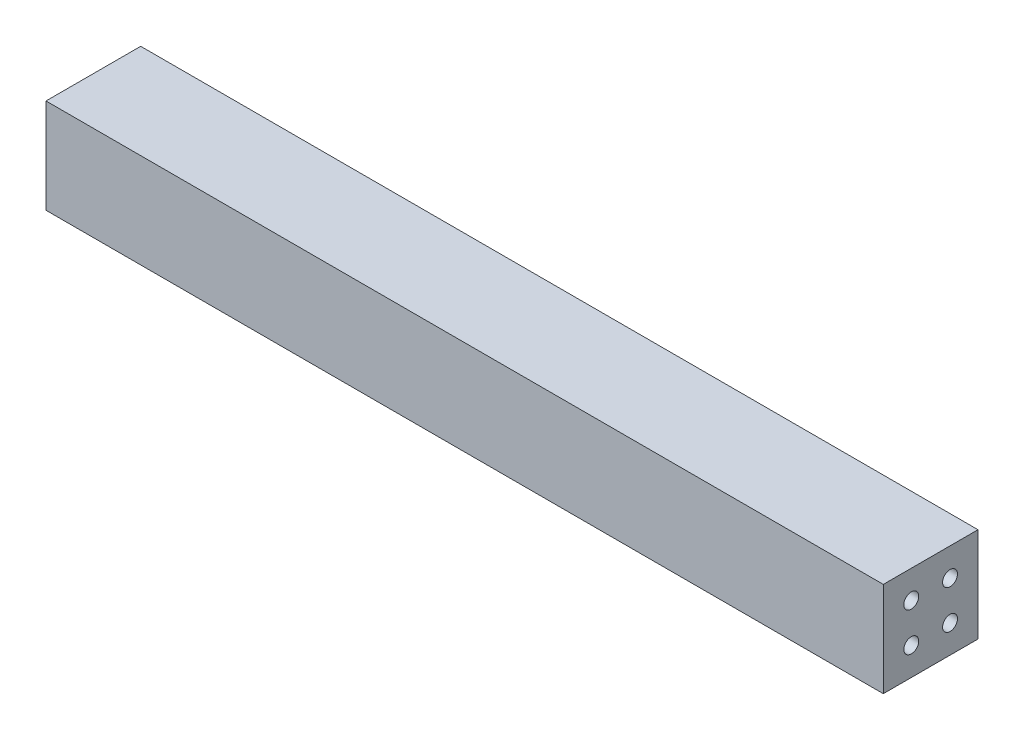
ISO-10303-21;
HEADER;
FILE_DESCRIPTION(('STEP AP214'),'2;1');
FILE_NAME('part.step','',(''),(''),'','','');
FILE_SCHEMA(('AUTOMOTIVE_DESIGN { 1 0 10303 214 1 1 1 1 }'));
ENDSEC;
DATA;
#1=APPLICATION_CONTEXT('core data for automotive mechanical design processes');
#2=APPLICATION_PROTOCOL_DEFINITION('international standard','automotive_design',2000,#1);
#3=PRODUCT_CONTEXT('',#1,'mechanical');
#4=PRODUCT('Part','Part','',(#3));
#5=PRODUCT_RELATED_PRODUCT_CATEGORY('part','',(#4));
#6=PRODUCT_DEFINITION_FORMATION('','',#4);
#7=PRODUCT_DEFINITION_CONTEXT('part definition',#1,'design');
#8=PRODUCT_DEFINITION('design','',#6,#7);
#9=PRODUCT_DEFINITION_SHAPE('','',#8);
#10=(LENGTH_UNIT() NAMED_UNIT(*) SI_UNIT(.MILLI.,.METRE.));
#11=(NAMED_UNIT(*) PLANE_ANGLE_UNIT() SI_UNIT($,.RADIAN.));
#12=(NAMED_UNIT(*) SI_UNIT($,.STERADIAN.) SOLID_ANGLE_UNIT());
#13=UNCERTAINTY_MEASURE_WITH_UNIT(LENGTH_MEASURE(1.E-05),#10,'distance_accuracy_value','');
#14=(GEOMETRIC_REPRESENTATION_CONTEXT(3) GLOBAL_UNCERTAINTY_ASSIGNED_CONTEXT((#13)) GLOBAL_UNIT_ASSIGNED_CONTEXT((#10,
#11,#12)) REPRESENTATION_CONTEXT('',''));
#15=CARTESIAN_POINT('',(0.,0.,0.));
#16=DIRECTION('',(0.,0.,1.));
#17=DIRECTION('',(1.,0.,0.));
#18=AXIS2_PLACEMENT_3D('',#15,#16,#17);
#19=CARTESIAN_POINT('',(224.6,50.8,-25.4));
#20=DIRECTION('',(-1.,0.,0.));
#21=DIRECTION('',(0.,0.,1.));
#22=AXIS2_PLACEMENT_3D('',#19,#20,#21);
#23=PLANE('',#22);
#24=CARTESIAN_POINT('',(224.6,15.0000000000001,10.3999999999998));
#25=DIRECTION('',(1.,0.,0.));
#26=DIRECTION('',(0.,0.,-1.));
#27=AXIS2_PLACEMENT_3D('',#24,#25,#26);
#28=CIRCLE('',#27,4.);
#29=CARTESIAN_POINT('',(224.6,15.0000000000001,6.39999999999981));
#30=VERTEX_POINT('',#29);
#31=EDGE_CURVE('E128',#30,#30,#28,.T.);
#32=ORIENTED_EDGE('',*,*,#31,.F.);
#33=EDGE_LOOP('',(#32));
#34=FACE_BOUND('',#33,.T.);
#35=CARTESIAN_POINT('',(224.6,15.0000000000002,-10.4000000000002));
#36=DIRECTION('',(1.,0.,0.));
#37=DIRECTION('',(0.,0.,-1.));
#38=AXIS2_PLACEMENT_3D('',#35,#36,#37);
#39=CIRCLE('',#38,4.);
#40=CARTESIAN_POINT('',(224.6,15.0000000000002,-14.4000000000002));
#41=VERTEX_POINT('',#40);
#42=EDGE_CURVE('E122',#41,#41,#39,.T.);
#43=ORIENTED_EDGE('',*,*,#42,.F.);
#44=EDGE_LOOP('',(#43));
#45=FACE_BOUND('',#44,.T.);
#46=CARTESIAN_POINT('',(224.6,35.8000000000002,-10.4));
#47=DIRECTION('',(1.,0.,0.));
#48=DIRECTION('',(0.,0.,-1.));
#49=AXIS2_PLACEMENT_3D('',#46,#47,#48);
#50=CIRCLE('',#49,4.);
#51=CARTESIAN_POINT('',(224.6,35.8000000000002,-14.4));
#52=VERTEX_POINT('',#51);
#53=EDGE_CURVE('E116',#52,#52,#50,.T.);
#54=ORIENTED_EDGE('',*,*,#53,.F.);
#55=EDGE_LOOP('',(#54));
#56=FACE_BOUND('',#55,.T.);
#57=CARTESIAN_POINT('',(224.6,35.8,10.4));
#58=DIRECTION('',(1.,0.,0.));
#59=DIRECTION('',(0.,0.,-1.));
#60=AXIS2_PLACEMENT_3D('',#57,#58,#59);
#61=CIRCLE('',#60,4.);
#62=CARTESIAN_POINT('',(224.6,35.8,6.39999999999999));
#63=VERTEX_POINT('',#62);
#64=EDGE_CURVE('E110',#63,#63,#61,.T.);
#65=ORIENTED_EDGE('',*,*,#64,.F.);
#66=EDGE_LOOP('',(#65));
#67=FACE_BOUND('',#66,.T.);
#68=DIRECTION('',(0.,0.,-1.));
#69=VECTOR('',#68,1.);
#70=CARTESIAN_POINT('',(224.6,0.,-25.4));
#71=LINE('',#70,#69);
#72=CARTESIAN_POINT('',(224.6,0.,25.4));
#73=VERTEX_POINT('',#72);
#74=CARTESIAN_POINT('',(224.6,0.,-25.4));
#75=VERTEX_POINT('',#74);
#76=EDGE_CURVE('E96',#73,#75,#71,.T.);
#77=ORIENTED_EDGE('',*,*,#76,.T.);
#78=DIRECTION('',(0.,-1.,0.));
#79=VECTOR('',#78,1.);
#80=CARTESIAN_POINT('',(224.6,50.8,-25.4));
#81=LINE('',#80,#79);
#82=CARTESIAN_POINT('',(224.6,50.8,-25.4));
#83=VERTEX_POINT('',#82);
#84=EDGE_CURVE('E11',#83,#75,#81,.T.);
#85=ORIENTED_EDGE('',*,*,#84,.F.);
#86=DIRECTION('',(0.,0.,-1.));
#87=VECTOR('',#86,1.);
#88=CARTESIAN_POINT('',(224.6,50.8,-25.4));
#89=LINE('',#88,#87);
#90=CARTESIAN_POINT('',(224.6,50.8,25.4));
#91=VERTEX_POINT('',#90);
#92=EDGE_CURVE('E84',#91,#83,#89,.T.);
#93=ORIENTED_EDGE('',*,*,#92,.F.);
#94=DIRECTION('',(0.,-1.,0.));
#95=VECTOR('',#94,1.);
#96=CARTESIAN_POINT('',(224.6,50.8,25.4));
#97=LINE('',#96,#95);
#98=EDGE_CURVE('E92',#91,#73,#97,.T.);
#99=ORIENTED_EDGE('',*,*,#98,.T.);
#100=EDGE_LOOP('',(#77,#85,#93,#99));
#101=FACE_BOUND('',#100,.T.);
#102=ADVANCED_FACE('F33',(#34,#45,#56,#67,#101),#23,.F.);
#103=CARTESIAN_POINT('',(-224.6,50.8,-25.4));
#104=DIRECTION('',(0.,0.,1.));
#105=DIRECTION('',(1.,0.,0.));
#106=AXIS2_PLACEMENT_3D('',#103,#104,#105);
#107=PLANE('',#106);
#108=DIRECTION('',(-1.,0.,0.));
#109=VECTOR('',#108,1.);
#110=CARTESIAN_POINT('',(-224.6,0.,-25.4));
#111=LINE('',#110,#109);
#112=CARTESIAN_POINT('',(-224.6,0.,-25.4));
#113=VERTEX_POINT('',#112);
#114=EDGE_CURVE('E88',#75,#113,#111,.T.);
#115=ORIENTED_EDGE('',*,*,#114,.T.);
#116=DIRECTION('',(0.,-1.,0.));
#117=VECTOR('',#116,1.);
#118=CARTESIAN_POINT('',(-224.6,50.8,-25.4));
#119=LINE('',#118,#117);
#120=CARTESIAN_POINT('',(-224.6,50.8,-25.4));
#121=VERTEX_POINT('',#120);
#122=EDGE_CURVE('E41',#121,#113,#119,.T.);
#123=ORIENTED_EDGE('',*,*,#122,.F.);
#124=DIRECTION('',(-1.,0.,0.));
#125=VECTOR('',#124,1.);
#126=CARTESIAN_POINT('',(-224.6,50.8,-25.4));
#127=LINE('',#126,#125);
#128=EDGE_CURVE('E79',#83,#121,#127,.T.);
#129=ORIENTED_EDGE('',*,*,#128,.F.);
#130=ORIENTED_EDGE('',*,*,#84,.T.);
#131=EDGE_LOOP('',(#115,#123,#129,#130));
#132=FACE_BOUND('',#131,.T.);
#133=ADVANCED_FACE('F87',(#132),#107,.F.);
#134=CARTESIAN_POINT('',(-224.6,50.8,-25.4));
#135=DIRECTION('',(1.,0.,0.));
#136=DIRECTION('',(0.,0.,-1.));
#137=AXIS2_PLACEMENT_3D('',#134,#135,#136);
#138=PLANE('',#137);
#139=CARTESIAN_POINT('',(-224.6,15.0000000000001,10.3999999999998));
#140=DIRECTION('',(-1.,0.,0.));
#141=DIRECTION('',(0.,0.,1.));
#142=AXIS2_PLACEMENT_3D('',#139,#140,#141);
#143=CIRCLE('',#142,4.);
#144=CARTESIAN_POINT('',(-224.6,15.0000000000001,14.3999999999998));
#145=VERTEX_POINT('',#144);
#146=EDGE_CURVE('E152',#145,#145,#143,.T.);
#147=ORIENTED_EDGE('',*,*,#146,.F.);
#148=EDGE_LOOP('',(#147));
#149=FACE_BOUND('',#148,.T.);
#150=CARTESIAN_POINT('',(-224.6,15.0000000000002,-10.4000000000002));
#151=DIRECTION('',(-1.,0.,0.));
#152=DIRECTION('',(0.,0.,1.));
#153=AXIS2_PLACEMENT_3D('',#150,#151,#152);
#154=CIRCLE('',#153,4.);
#155=CARTESIAN_POINT('',(-224.6,15.0000000000002,-6.40000000000021));
#156=VERTEX_POINT('',#155);
#157=EDGE_CURVE('E146',#156,#156,#154,.T.);
#158=ORIENTED_EDGE('',*,*,#157,.F.);
#159=EDGE_LOOP('',(#158));
#160=FACE_BOUND('',#159,.T.);
#161=CARTESIAN_POINT('',(-224.6,35.8000000000002,-10.4));
#162=DIRECTION('',(-1.,0.,0.));
#163=DIRECTION('',(0.,0.,1.));
#164=AXIS2_PLACEMENT_3D('',#161,#162,#163);
#165=CIRCLE('',#164,4.00000000000001);
#166=CARTESIAN_POINT('',(-224.6,35.8000000000002,-6.40000000000002));
#167=VERTEX_POINT('',#166);
#168=EDGE_CURVE('E140',#167,#167,#165,.T.);
#169=ORIENTED_EDGE('',*,*,#168,.F.);
#170=EDGE_LOOP('',(#169));
#171=FACE_BOUND('',#170,.T.);
#172=CARTESIAN_POINT('',(-224.6,35.8,10.4));
#173=DIRECTION('',(-1.,0.,0.));
#174=DIRECTION('',(0.,0.,1.));
#175=AXIS2_PLACEMENT_3D('',#172,#173,#174);
#176=CIRCLE('',#175,4.);
#177=CARTESIAN_POINT('',(-224.6,35.8,14.4));
#178=VERTEX_POINT('',#177);
#179=EDGE_CURVE('E134',#178,#178,#176,.T.);
#180=ORIENTED_EDGE('',*,*,#179,.F.);
#181=EDGE_LOOP('',(#180));
#182=FACE_BOUND('',#181,.T.);
#183=DIRECTION('',(0.,0.,1.));
#184=VECTOR('',#183,1.);
#185=CARTESIAN_POINT('',(-224.6,0.,-25.4));
#186=LINE('',#185,#184);
#187=CARTESIAN_POINT('',(-224.6,0.,25.4));
#188=VERTEX_POINT('',#187);
#189=EDGE_CURVE('E66',#113,#188,#186,.T.);
#190=ORIENTED_EDGE('',*,*,#189,.T.);
#191=DIRECTION('',(0.,-1.,0.));
#192=VECTOR('',#191,1.);
#193=CARTESIAN_POINT('',(-224.6,50.8,25.4));
#194=LINE('',#193,#192);
#195=CARTESIAN_POINT('',(-224.6,50.8,25.4));
#196=VERTEX_POINT('',#195);
#197=EDGE_CURVE('E89',#196,#188,#194,.T.);
#198=ORIENTED_EDGE('',*,*,#197,.F.);
#199=DIRECTION('',(0.,0.,1.));
#200=VECTOR('',#199,1.);
#201=CARTESIAN_POINT('',(-224.6,50.8,-25.4));
#202=LINE('',#201,#200);
#203=EDGE_CURVE('E82',#121,#196,#202,.T.);
#204=ORIENTED_EDGE('',*,*,#203,.F.);
#205=ORIENTED_EDGE('',*,*,#122,.T.);
#206=EDGE_LOOP('',(#190,#198,#204,#205));
#207=FACE_BOUND('',#206,.T.);
#208=ADVANCED_FACE('F90',(#149,#160,#171,#182,#207),#138,.F.);
#209=CARTESIAN_POINT('',(-224.6,50.8,25.4));
#210=DIRECTION('',(0.,0.,-1.));
#211=DIRECTION('',(-1.,0.,0.));
#212=AXIS2_PLACEMENT_3D('',#209,#210,#211);
#213=PLANE('',#212);
#214=DIRECTION('',(1.,0.,0.));
#215=VECTOR('',#214,1.);
#216=CARTESIAN_POINT('',(-224.6,0.,25.4));
#217=LINE('',#216,#215);
#218=EDGE_CURVE('E72',#188,#73,#217,.T.);
#219=ORIENTED_EDGE('',*,*,#218,.T.);
#220=ORIENTED_EDGE('',*,*,#98,.F.);
#221=DIRECTION('',(1.,0.,0.));
#222=VECTOR('',#221,1.);
#223=CARTESIAN_POINT('',(-224.6,50.8,25.4));
#224=LINE('',#223,#222);
#225=EDGE_CURVE('E49',#196,#91,#224,.T.);
#226=ORIENTED_EDGE('',*,*,#225,.F.);
#227=ORIENTED_EDGE('',*,*,#197,.T.);
#228=EDGE_LOOP('',(#219,#220,#226,#227));
#229=FACE_BOUND('',#228,.T.);
#230=ADVANCED_FACE('F104',(#229),#213,.F.);
#231=CARTESIAN_POINT('',(0.,50.8,0.));
#232=DIRECTION('',(0.,1.,0.));
#233=DIRECTION('',(0.,0.,1.));
#234=AXIS2_PLACEMENT_3D('',#231,#232,#233);
#235=PLANE('',#234);
#236=ORIENTED_EDGE('',*,*,#92,.T.);
#237=ORIENTED_EDGE('',*,*,#128,.T.);
#238=ORIENTED_EDGE('',*,*,#203,.T.);
#239=ORIENTED_EDGE('',*,*,#225,.T.);
#240=EDGE_LOOP('',(#236,#237,#238,#239));
#241=FACE_BOUND('',#240,.T.);
#242=ADVANCED_FACE('F80',(#241),#235,.T.);
#243=CARTESIAN_POINT('',(0.,0.,0.));
#244=DIRECTION('',(0.,1.,0.));
#245=DIRECTION('',(0.,0.,1.));
#246=AXIS2_PLACEMENT_3D('',#243,#244,#245);
#247=PLANE('',#246);
#248=ORIENTED_EDGE('',*,*,#76,.F.);
#249=ORIENTED_EDGE('',*,*,#218,.F.);
#250=ORIENTED_EDGE('',*,*,#189,.F.);
#251=ORIENTED_EDGE('',*,*,#114,.F.);
#252=EDGE_LOOP('',(#248,#249,#250,#251));
#253=FACE_BOUND('',#252,.T.);
#254=ADVANCED_FACE('F107',(#253),#247,.F.);
#255=CARTESIAN_POINT('',(214.6,35.8,10.4));
#256=DIRECTION('',(1.,0.,0.));
#257=DIRECTION('',(0.,0.,-1.));
#258=AXIS2_PLACEMENT_3D('',#255,#256,#257);
#259=CYLINDRICAL_SURFACE('',#258,4.);
#260=CARTESIAN_POINT('',(214.6,35.8,10.4));
#261=DIRECTION('',(1.,0.,0.));
#262=DIRECTION('',(0.,0.,-1.));
#263=AXIS2_PLACEMENT_3D('',#260,#261,#262);
#264=CIRCLE('',#263,4.);
#265=CARTESIAN_POINT('',(214.6,35.8,6.39999999999999));
#266=VERTEX_POINT('',#265);
#267=EDGE_CURVE('E99',#266,#266,#264,.T.);
#268=ORIENTED_EDGE('',*,*,#267,.F.);
#269=EDGE_LOOP('',(#268));
#270=FACE_BOUND('',#269,.T.);
#271=ORIENTED_EDGE('',*,*,#64,.T.);
#272=EDGE_LOOP('',(#271));
#273=FACE_BOUND('',#272,.T.);
#274=ADVANCED_FACE('F206',(#270,#273),#259,.F.);
#275=CARTESIAN_POINT('',(214.6,35.8,10.4));
#276=DIRECTION('',(1.,0.,0.));
#277=DIRECTION('',(0.,0.,-1.));
#278=AXIS2_PLACEMENT_3D('',#275,#276,#277);
#279=PLANE('',#278);
#280=ORIENTED_EDGE('',*,*,#267,.T.);
#281=EDGE_LOOP('',(#280));
#282=FACE_BOUND('',#281,.T.);
#283=ADVANCED_FACE('F208',(#282),#279,.T.);
#284=CARTESIAN_POINT('',(214.6,35.8000000000002,-10.4));
#285=DIRECTION('',(1.,0.,0.));
#286=DIRECTION('',(0.,0.,-1.));
#287=AXIS2_PLACEMENT_3D('',#284,#285,#286);
#288=CYLINDRICAL_SURFACE('',#287,4.);
#289=CARTESIAN_POINT('',(214.6,35.8000000000002,-10.4));
#290=DIRECTION('',(1.,0.,0.));
#291=DIRECTION('',(0.,0.,-1.));
#292=AXIS2_PLACEMENT_3D('',#289,#290,#291);
#293=CIRCLE('',#292,4.);
#294=CARTESIAN_POINT('',(214.6,35.8000000000002,-14.4));
#295=VERTEX_POINT('',#294);
#296=EDGE_CURVE('E113',#295,#295,#293,.T.);
#297=ORIENTED_EDGE('',*,*,#296,.F.);
#298=EDGE_LOOP('',(#297));
#299=FACE_BOUND('',#298,.T.);
#300=ORIENTED_EDGE('',*,*,#53,.T.);
#301=EDGE_LOOP('',(#300));
#302=FACE_BOUND('',#301,.T.);
#303=ADVANCED_FACE('F215',(#299,#302),#288,.F.);
#304=CARTESIAN_POINT('',(214.6,35.8000000000002,-10.4));
#305=DIRECTION('',(1.,0.,0.));
#306=DIRECTION('',(0.,0.,-1.));
#307=AXIS2_PLACEMENT_3D('',#304,#305,#306);
#308=PLANE('',#307);
#309=ORIENTED_EDGE('',*,*,#296,.T.);
#310=EDGE_LOOP('',(#309));
#311=FACE_BOUND('',#310,.T.);
#312=ADVANCED_FACE('F262',(#311),#308,.T.);
#313=CARTESIAN_POINT('',(214.6,15.0000000000002,-10.4000000000002));
#314=DIRECTION('',(1.,0.,0.));
#315=DIRECTION('',(0.,0.,-1.));
#316=AXIS2_PLACEMENT_3D('',#313,#314,#315);
#317=CYLINDRICAL_SURFACE('',#316,4.);
#318=CARTESIAN_POINT('',(214.6,15.0000000000002,-10.4000000000002));
#319=DIRECTION('',(1.,0.,0.));
#320=DIRECTION('',(0.,0.,-1.));
#321=AXIS2_PLACEMENT_3D('',#318,#319,#320);
#322=CIRCLE('',#321,4.);
#323=CARTESIAN_POINT('',(214.6,15.0000000000002,-14.4000000000002));
#324=VERTEX_POINT('',#323);
#325=EDGE_CURVE('E119',#324,#324,#322,.T.);
#326=ORIENTED_EDGE('',*,*,#325,.F.);
#327=EDGE_LOOP('',(#326));
#328=FACE_BOUND('',#327,.T.);
#329=ORIENTED_EDGE('',*,*,#42,.T.);
#330=EDGE_LOOP('',(#329));
#331=FACE_BOUND('',#330,.T.);
#332=ADVANCED_FACE('F271',(#328,#331),#317,.F.);
#333=CARTESIAN_POINT('',(214.6,15.0000000000002,-10.4000000000002));
#334=DIRECTION('',(1.,0.,0.));
#335=DIRECTION('',(0.,0.,-1.));
#336=AXIS2_PLACEMENT_3D('',#333,#334,#335);
#337=PLANE('',#336);
#338=ORIENTED_EDGE('',*,*,#325,.T.);
#339=EDGE_LOOP('',(#338));
#340=FACE_BOUND('',#339,.T.);
#341=ADVANCED_FACE('F281',(#340),#337,.T.);
#342=CARTESIAN_POINT('',(214.6,15.0000000000001,10.3999999999998));
#343=DIRECTION('',(1.,0.,0.));
#344=DIRECTION('',(0.,0.,-1.));
#345=AXIS2_PLACEMENT_3D('',#342,#343,#344);
#346=CYLINDRICAL_SURFACE('',#345,4.);
#347=CARTESIAN_POINT('',(214.6,15.0000000000001,10.3999999999998));
#348=DIRECTION('',(1.,0.,0.));
#349=DIRECTION('',(0.,0.,-1.));
#350=AXIS2_PLACEMENT_3D('',#347,#348,#349);
#351=CIRCLE('',#350,4.);
#352=CARTESIAN_POINT('',(214.6,15.0000000000001,6.39999999999981));
#353=VERTEX_POINT('',#352);
#354=EDGE_CURVE('E125',#353,#353,#351,.T.);
#355=ORIENTED_EDGE('',*,*,#354,.F.);
#356=EDGE_LOOP('',(#355));
#357=FACE_BOUND('',#356,.T.);
#358=ORIENTED_EDGE('',*,*,#31,.T.);
#359=EDGE_LOOP('',(#358));
#360=FACE_BOUND('',#359,.T.);
#361=ADVANCED_FACE('F189',(#357,#360),#346,.F.);
#362=CARTESIAN_POINT('',(214.6,15.0000000000001,10.3999999999998));
#363=DIRECTION('',(1.,0.,0.));
#364=DIRECTION('',(0.,0.,-1.));
#365=AXIS2_PLACEMENT_3D('',#362,#363,#364);
#366=PLANE('',#365);
#367=ORIENTED_EDGE('',*,*,#354,.T.);
#368=EDGE_LOOP('',(#367));
#369=FACE_BOUND('',#368,.T.);
#370=ADVANCED_FACE('F179',(#369),#366,.T.);
#371=CARTESIAN_POINT('',(-214.6,35.8,10.4));
#372=DIRECTION('',(-1.,0.,0.));
#373=DIRECTION('',(0.,0.,1.));
#374=AXIS2_PLACEMENT_3D('',#371,#372,#373);
#375=CYLINDRICAL_SURFACE('',#374,4.);
#376=CARTESIAN_POINT('',(-214.6,35.8,10.4));
#377=DIRECTION('',(-1.,0.,0.));
#378=DIRECTION('',(0.,0.,1.));
#379=AXIS2_PLACEMENT_3D('',#376,#377,#378);
#380=CIRCLE('',#379,4.);
#381=CARTESIAN_POINT('',(-214.6,35.8,14.4));
#382=VERTEX_POINT('',#381);
#383=EDGE_CURVE('E131',#382,#382,#380,.T.);
#384=ORIENTED_EDGE('',*,*,#383,.F.);
#385=EDGE_LOOP('',(#384));
#386=FACE_BOUND('',#385,.T.);
#387=ORIENTED_EDGE('',*,*,#179,.T.);
#388=EDGE_LOOP('',(#387));
#389=FACE_BOUND('',#388,.T.);
#390=ADVANCED_FACE('F176',(#386,#389),#375,.F.);
#391=CARTESIAN_POINT('',(-214.6,35.8,10.4));
#392=DIRECTION('',(-1.,0.,0.));
#393=DIRECTION('',(0.,0.,1.));
#394=AXIS2_PLACEMENT_3D('',#391,#392,#393);
#395=PLANE('',#394);
#396=ORIENTED_EDGE('',*,*,#383,.T.);
#397=EDGE_LOOP('',(#396));
#398=FACE_BOUND('',#397,.T.);
#399=ADVANCED_FACE('F178',(#398),#395,.T.);
#400=CARTESIAN_POINT('',(-214.6,35.8000000000002,-10.4));
#401=DIRECTION('',(-1.,0.,0.));
#402=DIRECTION('',(0.,0.,1.));
#403=AXIS2_PLACEMENT_3D('',#400,#401,#402);
#404=CYLINDRICAL_SURFACE('',#403,4.00000000000001);
#405=CARTESIAN_POINT('',(-214.6,35.8000000000002,-10.4));
#406=DIRECTION('',(-1.,0.,0.));
#407=DIRECTION('',(0.,0.,1.));
#408=AXIS2_PLACEMENT_3D('',#405,#406,#407);
#409=CIRCLE('',#408,4.00000000000001);
#410=CARTESIAN_POINT('',(-214.6,35.8000000000002,-6.40000000000002));
#411=VERTEX_POINT('',#410);
#412=EDGE_CURVE('E137',#411,#411,#409,.T.);
#413=ORIENTED_EDGE('',*,*,#412,.F.);
#414=EDGE_LOOP('',(#413));
#415=FACE_BOUND('',#414,.T.);
#416=ORIENTED_EDGE('',*,*,#168,.T.);
#417=EDGE_LOOP('',(#416));
#418=FACE_BOUND('',#417,.T.);
#419=ADVANCED_FACE('F186',(#415,#418),#404,.F.);
#420=CARTESIAN_POINT('',(-214.6,35.8000000000002,-10.4));
#421=DIRECTION('',(-1.,0.,0.));
#422=DIRECTION('',(0.,0.,1.));
#423=AXIS2_PLACEMENT_3D('',#420,#421,#422);
#424=PLANE('',#423);
#425=ORIENTED_EDGE('',*,*,#412,.T.);
#426=EDGE_LOOP('',(#425));
#427=FACE_BOUND('',#426,.T.);
#428=ADVANCED_FACE('F329',(#427),#424,.T.);
#429=CARTESIAN_POINT('',(-214.6,15.0000000000002,-10.4000000000002));
#430=DIRECTION('',(-1.,0.,0.));
#431=DIRECTION('',(0.,0.,1.));
#432=AXIS2_PLACEMENT_3D('',#429,#430,#431);
#433=CYLINDRICAL_SURFACE('',#432,4.);
#434=CARTESIAN_POINT('',(-214.6,15.0000000000002,-10.4000000000002));
#435=DIRECTION('',(-1.,0.,0.));
#436=DIRECTION('',(0.,0.,1.));
#437=AXIS2_PLACEMENT_3D('',#434,#435,#436);
#438=CIRCLE('',#437,4.);
#439=CARTESIAN_POINT('',(-214.6,15.0000000000002,-6.40000000000021));
#440=VERTEX_POINT('',#439);
#441=EDGE_CURVE('E143',#440,#440,#438,.T.);
#442=ORIENTED_EDGE('',*,*,#441,.F.);
#443=EDGE_LOOP('',(#442));
#444=FACE_BOUND('',#443,.T.);
#445=ORIENTED_EDGE('',*,*,#157,.T.);
#446=EDGE_LOOP('',(#445));
#447=FACE_BOUND('',#446,.T.);
#448=ADVANCED_FACE('F339',(#444,#447),#433,.F.);
#449=CARTESIAN_POINT('',(-214.6,15.0000000000002,-10.4000000000002));
#450=DIRECTION('',(-1.,0.,0.));
#451=DIRECTION('',(0.,0.,1.));
#452=AXIS2_PLACEMENT_3D('',#449,#450,#451);
#453=PLANE('',#452);
#454=ORIENTED_EDGE('',*,*,#441,.T.);
#455=EDGE_LOOP('',(#454));
#456=FACE_BOUND('',#455,.T.);
#457=ADVANCED_FACE('F163',(#456),#453,.T.);
#458=CARTESIAN_POINT('',(-214.6,15.0000000000001,10.3999999999998));
#459=DIRECTION('',(-1.,0.,0.));
#460=DIRECTION('',(0.,0.,1.));
#461=AXIS2_PLACEMENT_3D('',#458,#459,#460);
#462=CYLINDRICAL_SURFACE('',#461,4.);
#463=CARTESIAN_POINT('',(-214.6,15.0000000000001,10.3999999999998));
#464=DIRECTION('',(-1.,0.,0.));
#465=DIRECTION('',(0.,0.,1.));
#466=AXIS2_PLACEMENT_3D('',#463,#464,#465);
#467=CIRCLE('',#466,4.);
#468=CARTESIAN_POINT('',(-214.6,15.0000000000001,14.3999999999998));
#469=VERTEX_POINT('',#468);
#470=EDGE_CURVE('E149',#469,#469,#467,.T.);
#471=ORIENTED_EDGE('',*,*,#470,.F.);
#472=EDGE_LOOP('',(#471));
#473=FACE_BOUND('',#472,.T.);
#474=ORIENTED_EDGE('',*,*,#146,.T.);
#475=EDGE_LOOP('',(#474));
#476=FACE_BOUND('',#475,.T.);
#477=ADVANCED_FACE('F160',(#473,#476),#462,.F.);
#478=CARTESIAN_POINT('',(-214.6,15.0000000000001,10.3999999999998));
#479=DIRECTION('',(-1.,0.,0.));
#480=DIRECTION('',(0.,0.,1.));
#481=AXIS2_PLACEMENT_3D('',#478,#479,#480);
#482=PLANE('',#481);
#483=ORIENTED_EDGE('',*,*,#470,.T.);
#484=EDGE_LOOP('',(#483));
#485=FACE_BOUND('',#484,.T.);
#486=ADVANCED_FACE('F158',(#485),#482,.T.);
#487=CLOSED_SHELL('',(#102,#133,#208,#230,#242,#254,#274,#283,#303,#312,#332,#341,#361,#370,
#390,#399,#419,#428,#448,#457,#477,#486));
#488=MANIFOLD_SOLID_BREP('B2',#487);
#489=ADVANCED_BREP_SHAPE_REPRESENTATION('',(#18,#488),#14);
#490=SHAPE_DEFINITION_REPRESENTATION(#9,#489);
ENDSEC;
END-ISO-10303-21;
